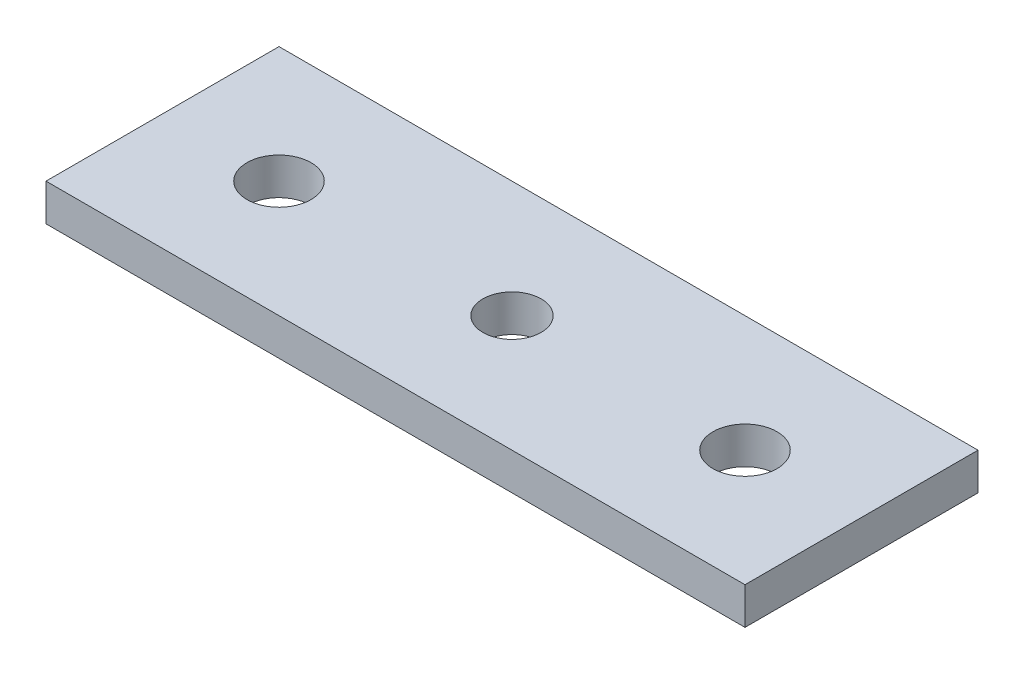
ISO-10303-21;
HEADER;
FILE_DESCRIPTION(('STEP AP214'),'2;1');
FILE_NAME('part.step','',(''),(''),'','','');
FILE_SCHEMA(('AUTOMOTIVE_DESIGN { 1 0 10303 214 1 1 1 1 }'));
ENDSEC;
DATA;
#1=APPLICATION_CONTEXT('core data for automotive mechanical design processes');
#2=APPLICATION_PROTOCOL_DEFINITION('international standard','automotive_design',2000,#1);
#3=PRODUCT_CONTEXT('',#1,'mechanical');
#4=PRODUCT('Part','Part','',(#3));
#5=PRODUCT_RELATED_PRODUCT_CATEGORY('part','',(#4));
#6=PRODUCT_DEFINITION_FORMATION('','',#4);
#7=PRODUCT_DEFINITION_CONTEXT('part definition',#1,'design');
#8=PRODUCT_DEFINITION('design','',#6,#7);
#9=PRODUCT_DEFINITION_SHAPE('','',#8);
#10=(LENGTH_UNIT() NAMED_UNIT(*) SI_UNIT(.MILLI.,.METRE.));
#11=(NAMED_UNIT(*) PLANE_ANGLE_UNIT() SI_UNIT($,.RADIAN.));
#12=(NAMED_UNIT(*) SI_UNIT($,.STERADIAN.) SOLID_ANGLE_UNIT());
#13=UNCERTAINTY_MEASURE_WITH_UNIT(LENGTH_MEASURE(1.E-05),#10,'distance_accuracy_value','');
#14=(GEOMETRIC_REPRESENTATION_CONTEXT(3) GLOBAL_UNCERTAINTY_ASSIGNED_CONTEXT((#13)) GLOBAL_UNIT_ASSIGNED_CONTEXT((#10,
#11,#12)) REPRESENTATION_CONTEXT('',''));
#15=CARTESIAN_POINT('',(0.,0.,0.));
#16=DIRECTION('',(0.,0.,1.));
#17=DIRECTION('',(1.,0.,0.));
#18=AXIS2_PLACEMENT_3D('',#15,#16,#17);
#19=CARTESIAN_POINT('',(0.,3.175,0.));
#20=DIRECTION('',(1.,0.,0.));
#21=DIRECTION('',(0.,0.,-1.));
#22=AXIS2_PLACEMENT_3D('',#19,#20,#21);
#23=PLANE('',#22);
#24=DIRECTION('',(0.,0.,1.));
#25=VECTOR('',#24,1.);
#26=CARTESIAN_POINT('',(0.,0.,0.));
#27=LINE('',#26,#25);
#28=CARTESIAN_POINT('',(0.,0.,-20.));
#29=VERTEX_POINT('',#28);
#30=CARTESIAN_POINT('',(0.,0.,0.));
#31=VERTEX_POINT('',#30);
#32=EDGE_CURVE('E109',#29,#31,#27,.T.);
#33=ORIENTED_EDGE('',*,*,#32,.T.);
#34=DIRECTION('',(0.,-1.,0.));
#35=VECTOR('',#34,1.);
#36=CARTESIAN_POINT('',(0.,3.175,0.));
#37=LINE('',#36,#35);
#38=CARTESIAN_POINT('',(0.,3.175,0.));
#39=VERTEX_POINT('',#38);
#40=EDGE_CURVE('E11',#39,#31,#37,.T.);
#41=ORIENTED_EDGE('',*,*,#40,.F.);
#42=DIRECTION('',(0.,0.,1.));
#43=VECTOR('',#42,1.);
#44=CARTESIAN_POINT('',(0.,3.175,0.));
#45=LINE('',#44,#43);
#46=CARTESIAN_POINT('',(0.,3.175,-20.));
#47=VERTEX_POINT('',#46);
#48=EDGE_CURVE('E93',#47,#39,#45,.T.);
#49=ORIENTED_EDGE('',*,*,#48,.F.);
#50=DIRECTION('',(0.,-1.,0.));
#51=VECTOR('',#50,1.);
#52=CARTESIAN_POINT('',(0.,3.175,-20.));
#53=LINE('',#52,#51);
#54=EDGE_CURVE('E105',#47,#29,#53,.T.);
#55=ORIENTED_EDGE('',*,*,#54,.T.);
#56=EDGE_LOOP('',(#33,#41,#49,#55));
#57=FACE_BOUND('',#56,.T.);
#58=ADVANCED_FACE('F41',(#57),#23,.F.);
#59=CARTESIAN_POINT('',(0.,3.175,0.));
#60=DIRECTION('',(0.,0.,-1.));
#61=DIRECTION('',(-1.,0.,0.));
#62=AXIS2_PLACEMENT_3D('',#59,#60,#61);
#63=PLANE('',#62);
#64=DIRECTION('',(1.,0.,0.));
#65=VECTOR('',#64,1.);
#66=CARTESIAN_POINT('',(0.,0.,0.));
#67=LINE('',#66,#65);
#68=CARTESIAN_POINT('',(60.,0.,0.));
#69=VERTEX_POINT('',#68);
#70=EDGE_CURVE('E98',#31,#69,#67,.T.);
#71=ORIENTED_EDGE('',*,*,#70,.T.);
#72=DIRECTION('',(0.,-1.,0.));
#73=VECTOR('',#72,1.);
#74=CARTESIAN_POINT('',(60.,3.175,0.));
#75=LINE('',#74,#73);
#76=CARTESIAN_POINT('',(60.,3.175,0.));
#77=VERTEX_POINT('',#76);
#78=EDGE_CURVE('E50',#77,#69,#75,.T.);
#79=ORIENTED_EDGE('',*,*,#78,.F.);
#80=DIRECTION('',(1.,0.,0.));
#81=VECTOR('',#80,1.);
#82=CARTESIAN_POINT('',(0.,3.175,0.));
#83=LINE('',#82,#81);
#84=EDGE_CURVE('E88',#39,#77,#83,.T.);
#85=ORIENTED_EDGE('',*,*,#84,.F.);
#86=ORIENTED_EDGE('',*,*,#40,.T.);
#87=EDGE_LOOP('',(#71,#79,#85,#86));
#88=FACE_BOUND('',#87,.T.);
#89=ADVANCED_FACE('F97',(#88),#63,.F.);
#90=CARTESIAN_POINT('',(60.,3.175,0.));
#91=DIRECTION('',(-1.,0.,0.));
#92=DIRECTION('',(0.,0.,1.));
#93=AXIS2_PLACEMENT_3D('',#90,#91,#92);
#94=PLANE('',#93);
#95=DIRECTION('',(0.,0.,-1.));
#96=VECTOR('',#95,1.);
#97=CARTESIAN_POINT('',(60.,0.,0.));
#98=LINE('',#97,#96);
#99=CARTESIAN_POINT('',(60.,0.,-20.));
#100=VERTEX_POINT('',#99);
#101=EDGE_CURVE('E75',#69,#100,#98,.T.);
#102=ORIENTED_EDGE('',*,*,#101,.T.);
#103=DIRECTION('',(0.,-1.,0.));
#104=VECTOR('',#103,1.);
#105=CARTESIAN_POINT('',(60.,3.175,-20.));
#106=LINE('',#105,#104);
#107=CARTESIAN_POINT('',(60.,3.175,-20.));
#108=VERTEX_POINT('',#107);
#109=EDGE_CURVE('E100',#108,#100,#106,.T.);
#110=ORIENTED_EDGE('',*,*,#109,.F.);
#111=DIRECTION('',(0.,0.,-1.));
#112=VECTOR('',#111,1.);
#113=CARTESIAN_POINT('',(60.,3.175,0.));
#114=LINE('',#113,#112);
#115=EDGE_CURVE('E91',#77,#108,#114,.T.);
#116=ORIENTED_EDGE('',*,*,#115,.F.);
#117=ORIENTED_EDGE('',*,*,#78,.T.);
#118=EDGE_LOOP('',(#102,#110,#116,#117));
#119=FACE_BOUND('',#118,.T.);
#120=ADVANCED_FACE('F101',(#119),#94,.F.);
#121=CARTESIAN_POINT('',(0.,3.175,-20.));
#122=DIRECTION('',(0.,0.,1.));
#123=DIRECTION('',(1.,0.,0.));
#124=AXIS2_PLACEMENT_3D('',#121,#122,#123);
#125=PLANE('',#124);
#126=DIRECTION('',(-1.,0.,0.));
#127=VECTOR('',#126,1.);
#128=CARTESIAN_POINT('',(0.,0.,-20.));
#129=LINE('',#128,#127);
#130=EDGE_CURVE('E81',#100,#29,#129,.T.);
#131=ORIENTED_EDGE('',*,*,#130,.T.);
#132=ORIENTED_EDGE('',*,*,#54,.F.);
#133=DIRECTION('',(-1.,0.,0.));
#134=VECTOR('',#133,1.);
#135=CARTESIAN_POINT('',(0.,3.175,-20.));
#136=LINE('',#135,#134);
#137=EDGE_CURVE('E58',#108,#47,#136,.T.);
#138=ORIENTED_EDGE('',*,*,#137,.F.);
#139=ORIENTED_EDGE('',*,*,#109,.T.);
#140=EDGE_LOOP('',(#131,#132,#138,#139));
#141=FACE_BOUND('',#140,.T.);
#142=ADVANCED_FACE('F123',(#141),#125,.F.);
#143=CARTESIAN_POINT('',(0.,3.175,0.));
#144=DIRECTION('',(0.,-1.,0.));
#145=DIRECTION('',(0.,0.,-1.));
#146=AXIS2_PLACEMENT_3D('',#143,#144,#145);
#147=PLANE('',#146);
#148=CARTESIAN_POINT('',(30.,3.175,-10.));
#149=DIRECTION('',(0.,-1.,0.));
#150=DIRECTION('',(0.,0.,-1.));
#151=AXIS2_PLACEMENT_3D('',#148,#149,#150);
#152=CIRCLE('',#151,2.5);
#153=CARTESIAN_POINT('',(30.,3.175,-12.5));
#154=VERTEX_POINT('',#153);
#155=EDGE_CURVE('E135',#154,#154,#152,.T.);
#156=ORIENTED_EDGE('',*,*,#155,.T.);
#157=EDGE_LOOP('',(#156));
#158=FACE_BOUND('',#157,.T.);
#159=CARTESIAN_POINT('',(50.,3.175,-10.));
#160=DIRECTION('',(0.,-1.,0.));
#161=DIRECTION('',(0.,0.,-1.));
#162=AXIS2_PLACEMENT_3D('',#159,#160,#161);
#163=CIRCLE('',#162,2.75);
#164=CARTESIAN_POINT('',(50.,3.175,-12.75));
#165=VERTEX_POINT('',#164);
#166=EDGE_CURVE('E113',#165,#165,#163,.T.);
#167=ORIENTED_EDGE('',*,*,#166,.T.);
#168=EDGE_LOOP('',(#167));
#169=FACE_BOUND('',#168,.T.);
#170=CARTESIAN_POINT('',(10.,3.175,-10.));
#171=DIRECTION('',(0.,-1.,0.));
#172=DIRECTION('',(0.,0.,-1.));
#173=AXIS2_PLACEMENT_3D('',#170,#171,#172);
#174=CIRCLE('',#173,2.75);
#175=CARTESIAN_POINT('',(10.,3.175,-12.75));
#176=VERTEX_POINT('',#175);
#177=EDGE_CURVE('E130',#176,#176,#174,.T.);
#178=ORIENTED_EDGE('',*,*,#177,.T.);
#179=EDGE_LOOP('',(#178));
#180=FACE_BOUND('',#179,.T.);
#181=ORIENTED_EDGE('',*,*,#48,.T.);
#182=ORIENTED_EDGE('',*,*,#84,.T.);
#183=ORIENTED_EDGE('',*,*,#115,.T.);
#184=ORIENTED_EDGE('',*,*,#137,.T.);
#185=EDGE_LOOP('',(#181,#182,#183,#184));
#186=FACE_BOUND('',#185,.T.);
#187=ADVANCED_FACE('F89',(#158,#169,#180,#186),#147,.F.);
#188=CARTESIAN_POINT('',(0.,0.,0.));
#189=DIRECTION('',(0.,-1.,0.));
#190=DIRECTION('',(0.,0.,-1.));
#191=AXIS2_PLACEMENT_3D('',#188,#189,#190);
#192=PLANE('',#191);
#193=CARTESIAN_POINT('',(30.,0.,-10.));
#194=DIRECTION('',(0.,-1.,0.));
#195=DIRECTION('',(0.,0.,-1.));
#196=AXIS2_PLACEMENT_3D('',#193,#194,#195);
#197=CIRCLE('',#196,2.49999999999999);
#198=CARTESIAN_POINT('',(30.,0.,-12.5));
#199=VERTEX_POINT('',#198);
#200=EDGE_CURVE('E149',#199,#199,#197,.T.);
#201=ORIENTED_EDGE('',*,*,#200,.F.);
#202=EDGE_LOOP('',(#201));
#203=FACE_BOUND('',#202,.T.);
#204=CARTESIAN_POINT('',(50.,0.,-10.));
#205=DIRECTION('',(0.,-1.,0.));
#206=DIRECTION('',(0.,0.,-1.));
#207=AXIS2_PLACEMENT_3D('',#204,#205,#206);
#208=CIRCLE('',#207,2.75);
#209=CARTESIAN_POINT('',(50.,0.,-12.75));
#210=VERTEX_POINT('',#209);
#211=EDGE_CURVE('E139',#210,#210,#208,.T.);
#212=ORIENTED_EDGE('',*,*,#211,.F.);
#213=EDGE_LOOP('',(#212));
#214=FACE_BOUND('',#213,.T.);
#215=CARTESIAN_POINT('',(10.,0.,-10.));
#216=DIRECTION('',(0.,-1.,0.));
#217=DIRECTION('',(0.,0.,-1.));
#218=AXIS2_PLACEMENT_3D('',#215,#216,#217);
#219=CIRCLE('',#218,2.75);
#220=CARTESIAN_POINT('',(10.,0.,-12.75));
#221=VERTEX_POINT('',#220);
#222=EDGE_CURVE('E134',#221,#221,#219,.T.);
#223=ORIENTED_EDGE('',*,*,#222,.F.);
#224=EDGE_LOOP('',(#223));
#225=FACE_BOUND('',#224,.T.);
#226=ORIENTED_EDGE('',*,*,#32,.F.);
#227=ORIENTED_EDGE('',*,*,#130,.F.);
#228=ORIENTED_EDGE('',*,*,#101,.F.);
#229=ORIENTED_EDGE('',*,*,#70,.F.);
#230=EDGE_LOOP('',(#226,#227,#228,#229));
#231=FACE_BOUND('',#230,.T.);
#232=ADVANCED_FACE('F126',(#203,#214,#225,#231),#192,.T.);
#233=CARTESIAN_POINT('',(10.,3.175,-10.));
#234=DIRECTION('',(0.,-1.,0.));
#235=DIRECTION('',(0.,0.,-1.));
#236=AXIS2_PLACEMENT_3D('',#233,#234,#235);
#237=CYLINDRICAL_SURFACE('',#236,2.75);
#238=ORIENTED_EDGE('',*,*,#177,.F.);
#239=EDGE_LOOP('',(#238));
#240=FACE_BOUND('',#239,.T.);
#241=ORIENTED_EDGE('',*,*,#222,.T.);
#242=EDGE_LOOP('',(#241));
#243=FACE_BOUND('',#242,.T.);
#244=ADVANCED_FACE('F158',(#240,#243),#237,.F.);
#245=CARTESIAN_POINT('',(50.,3.175,-10.));
#246=DIRECTION('',(0.,-1.,0.));
#247=DIRECTION('',(0.,0.,-1.));
#248=AXIS2_PLACEMENT_3D('',#245,#246,#247);
#249=CYLINDRICAL_SURFACE('',#248,2.75);
#250=ORIENTED_EDGE('',*,*,#166,.F.);
#251=EDGE_LOOP('',(#250));
#252=FACE_BOUND('',#251,.T.);
#253=ORIENTED_EDGE('',*,*,#211,.T.);
#254=EDGE_LOOP('',(#253));
#255=FACE_BOUND('',#254,.T.);
#256=ADVANCED_FACE('F165',(#252,#255),#249,.F.);
#257=CARTESIAN_POINT('',(30.,0.,-10.));
#258=DIRECTION('',(0.,-1.,0.));
#259=DIRECTION('',(0.,0.,-1.));
#260=AXIS2_PLACEMENT_3D('',#257,#258,#259);
#261=CYLINDRICAL_SURFACE('',#260,2.49999999999999);
#262=ORIENTED_EDGE('',*,*,#155,.F.);
#263=EDGE_LOOP('',(#262));
#264=FACE_BOUND('',#263,.T.);
#265=ORIENTED_EDGE('',*,*,#200,.T.);
#266=EDGE_LOOP('',(#265));
#267=FACE_BOUND('',#266,.T.);
#268=ADVANCED_FACE('F154',(#264,#267),#261,.F.);
#269=CLOSED_SHELL('',(#58,#89,#120,#142,#187,#232,#244,#256,#268));
#270=MANIFOLD_SOLID_BREP('B2',#269);
#271=ADVANCED_BREP_SHAPE_REPRESENTATION('',(#18,#270),#14);
#272=SHAPE_DEFINITION_REPRESENTATION(#9,#271);
ENDSEC;
END-ISO-10303-21;
